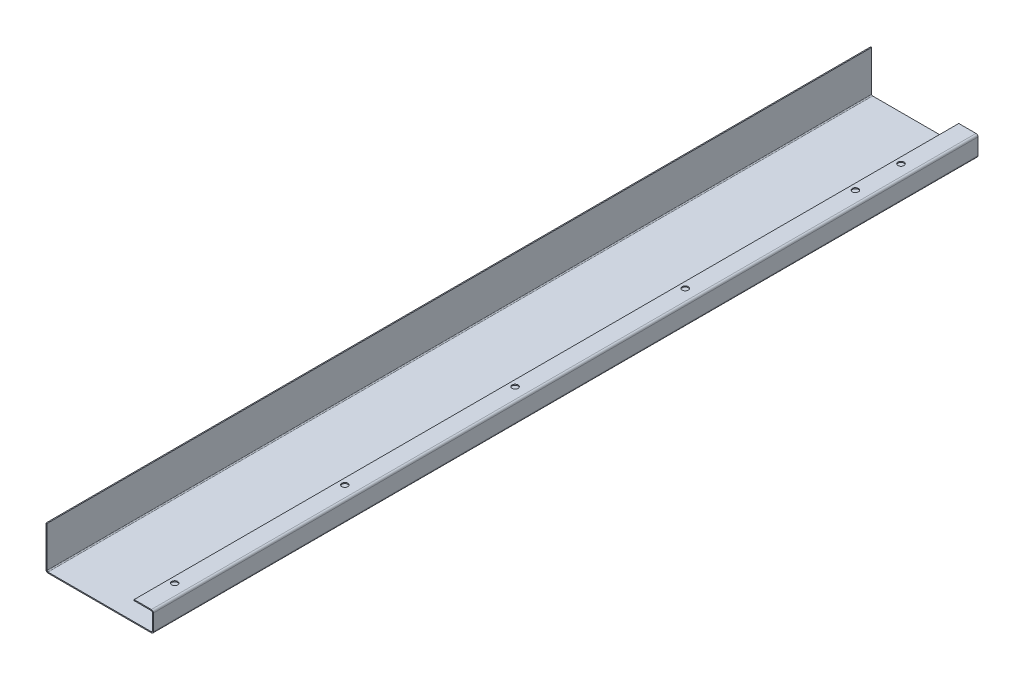
ISO-10303-21;
HEADER;
FILE_DESCRIPTION(('STEP AP214'),'2;1');
FILE_NAME('part.step','',(''),(''),'','','');
FILE_SCHEMA(('AUTOMOTIVE_DESIGN { 1 0 10303 214 1 1 1 1 }'));
ENDSEC;
DATA;
#1=APPLICATION_CONTEXT('core data for automotive mechanical design processes');
#2=APPLICATION_PROTOCOL_DEFINITION('international standard','automotive_design',2000,#1);
#3=PRODUCT_CONTEXT('',#1,'mechanical');
#4=PRODUCT('Part','Part','',(#3));
#5=PRODUCT_RELATED_PRODUCT_CATEGORY('part','',(#4));
#6=PRODUCT_DEFINITION_FORMATION('','',#4);
#7=PRODUCT_DEFINITION_CONTEXT('part definition',#1,'design');
#8=PRODUCT_DEFINITION('design','',#6,#7);
#9=PRODUCT_DEFINITION_SHAPE('','',#8);
#10=(LENGTH_UNIT() NAMED_UNIT(*) SI_UNIT(.MILLI.,.METRE.));
#11=(NAMED_UNIT(*) PLANE_ANGLE_UNIT() SI_UNIT($,.RADIAN.));
#12=(NAMED_UNIT(*) SI_UNIT($,.STERADIAN.) SOLID_ANGLE_UNIT());
#13=UNCERTAINTY_MEASURE_WITH_UNIT(LENGTH_MEASURE(1.E-05),#10,'distance_accuracy_value','');
#14=(GEOMETRIC_REPRESENTATION_CONTEXT(3) GLOBAL_UNCERTAINTY_ASSIGNED_CONTEXT((#13)) GLOBAL_UNIT_ASSIGNED_CONTEXT((#10,
#11,#12)) REPRESENTATION_CONTEXT('',''));
#15=CARTESIAN_POINT('',(0.,0.,0.));
#16=DIRECTION('',(0.,0.,1.));
#17=DIRECTION('',(1.,0.,0.));
#18=AXIS2_PLACEMENT_3D('',#15,#16,#17);
#19=CARTESIAN_POINT('',(0.,-1.,0.));
#20=DIRECTION('',(0.,-1.,0.));
#21=DIRECTION('',(0.,0.,-1.));
#22=AXIS2_PLACEMENT_3D('',#19,#20,#21);
#23=PLANE('',#22);
#24=DIRECTION('',(1.,0.,0.));
#25=VECTOR('',#24,1.);
#26=CARTESIAN_POINT('',(0.,-1.,0.));
#27=LINE('',#26,#25);
#28=CARTESIAN_POINT('',(2.00000000000007,-1.0000000000001,0.));
#29=VERTEX_POINT('',#28);
#30=CARTESIAN_POINT('',(104.,-1.,0.));
#31=VERTEX_POINT('',#30);
#32=EDGE_CURVE('E112',#29,#31,#27,.T.);
#33=ORIENTED_EDGE('',*,*,#32,.F.);
#34=DIRECTION('',(0.,0.,1.));
#35=VECTOR('',#34,1.);
#36=CARTESIAN_POINT('',(2.00000000000007,-1.0000000000001,0.));
#37=LINE('',#36,#35);
#38=CARTESIAN_POINT('',(2.,-1.,-814.));
#39=VERTEX_POINT('',#38);
#40=EDGE_CURVE('E273',#29,#39,#37,.F.);
#41=ORIENTED_EDGE('',*,*,#40,.T.);
#42=DIRECTION('',(-1.,0.,0.));
#43=VECTOR('',#42,1.);
#44=CARTESIAN_POINT('',(-1.38777878078145E-13,-1.,-814.));
#45=LINE('',#44,#43);
#46=CARTESIAN_POINT('',(104.,-1.0000000000001,-814.));
#47=VERTEX_POINT('',#46);
#48=EDGE_CURVE('E13',#47,#39,#45,.T.);
#49=ORIENTED_EDGE('',*,*,#48,.F.);
#50=DIRECTION('',(0.,0.,-1.));
#51=VECTOR('',#50,1.);
#52=CARTESIAN_POINT('',(104.,-1.0000000000001,-814.));
#53=LINE('',#52,#51);
#54=EDGE_CURVE('E402',#47,#31,#53,.F.);
#55=ORIENTED_EDGE('',*,*,#54,.T.);
#56=EDGE_LOOP('',(#33,#41,#49,#55));
#57=FACE_BOUND('',#56,.T.);
#58=ADVANCED_FACE('F102',(#57),#23,.T.);
#59=CARTESIAN_POINT('',(0.,0.,0.));
#60=DIRECTION('',(0.,-1.,0.));
#61=DIRECTION('',(0.,0.,-1.));
#62=AXIS2_PLACEMENT_3D('',#59,#60,#61);
#63=PLANE('',#62);
#64=DIRECTION('',(0.,0.,1.));
#65=VECTOR('',#64,1.);
#66=CARTESIAN_POINT('',(2.,0.,0.));
#67=LINE('',#66,#65);
#68=CARTESIAN_POINT('',(2.,0.,0.));
#69=VERTEX_POINT('',#68);
#70=CARTESIAN_POINT('',(2.,0.,-814.));
#71=VERTEX_POINT('',#70);
#72=EDGE_CURVE('E290',#69,#71,#67,.F.);
#73=ORIENTED_EDGE('',*,*,#72,.F.);
#74=DIRECTION('',(1.,0.,0.));
#75=VECTOR('',#74,1.);
#76=CARTESIAN_POINT('',(0.,0.,0.));
#77=LINE('',#76,#75);
#78=CARTESIAN_POINT('',(104.,-1.00397121172158E-13,0.));
#79=VERTEX_POINT('',#78);
#80=EDGE_CURVE('E430',#69,#79,#77,.T.);
#81=ORIENTED_EDGE('',*,*,#80,.T.);
#82=DIRECTION('',(0.,0.,-1.));
#83=VECTOR('',#82,1.);
#84=CARTESIAN_POINT('',(104.,-1.00397121172158E-13,-814.));
#85=LINE('',#84,#83);
#86=CARTESIAN_POINT('',(104.,-1.00397121172158E-13,-814.));
#87=VERTEX_POINT('',#86);
#88=EDGE_CURVE('E419',#87,#79,#85,.F.);
#89=ORIENTED_EDGE('',*,*,#88,.F.);
#90=DIRECTION('',(-1.,0.,0.));
#91=VECTOR('',#90,1.);
#92=CARTESIAN_POINT('',(-1.38777878078145E-13,0.,-814.));
#93=LINE('',#92,#91);
#94=EDGE_CURVE('E435',#87,#71,#93,.T.);
#95=ORIENTED_EDGE('',*,*,#94,.T.);
#96=EDGE_LOOP('',(#73,#81,#89,#95));
#97=FACE_BOUND('',#96,.T.);
#98=ADVANCED_FACE('F525',(#97),#63,.F.);
#99=CARTESIAN_POINT('',(0.,-1.,0.));
#100=DIRECTION('',(0.,0.,1.));
#101=DIRECTION('',(1.,0.,0.));
#102=AXIS2_PLACEMENT_3D('',#99,#100,#101);
#103=PLANE('',#102);
#104=ORIENTED_EDGE('',*,*,#80,.F.);
#105=DIRECTION('',(0.,-1.,0.));
#106=VECTOR('',#105,1.);
#107=CARTESIAN_POINT('',(2.,0.,0.));
#108=LINE('',#107,#106);
#109=EDGE_CURVE('E282',#69,#29,#108,.T.);
#110=ORIENTED_EDGE('',*,*,#109,.T.);
#111=ORIENTED_EDGE('',*,*,#32,.T.);
#112=DIRECTION('',(0.,-1.,0.));
#113=VECTOR('',#112,1.);
#114=CARTESIAN_POINT('',(104.,-1.00397121172158E-13,0.));
#115=LINE('',#114,#113);
#116=EDGE_CURVE('E426',#79,#31,#115,.T.);
#117=ORIENTED_EDGE('',*,*,#116,.F.);
#118=EDGE_LOOP('',(#104,#110,#111,#117));
#119=FACE_BOUND('',#118,.T.);
#120=ADVANCED_FACE('F104',(#119),#103,.T.);
#121=CARTESIAN_POINT('',(106.,0.,0.));
#122=DIRECTION('',(0.,0.,-1.));
#123=DIRECTION('',(0.,1.,0.));
#124=AXIS2_PLACEMENT_3D('',#121,#122,#123);
#125=PLANE('',#124);
#126=DIRECTION('',(1.,0.,0.));
#127=VECTOR('',#126,1.);
#128=CARTESIAN_POINT('',(105.000000000003,17.,0.));
#129=LINE('',#128,#127);
#130=CARTESIAN_POINT('',(105.000000000003,17.,0.));
#131=VERTEX_POINT('',#130);
#132=CARTESIAN_POINT('',(106.,17.,0.));
#133=VERTEX_POINT('',#132);
#134=EDGE_CURVE('E367',#131,#133,#129,.T.);
#135=ORIENTED_EDGE('',*,*,#134,.F.);
#136=DIRECTION('',(0.,1.,0.));
#137=VECTOR('',#136,1.);
#138=CARTESIAN_POINT('',(105.,0.,0.));
#139=LINE('',#138,#137);
#140=CARTESIAN_POINT('',(105.,0.99999999999998,0.));
#141=VERTEX_POINT('',#140);
#142=EDGE_CURVE('E385',#131,#141,#139,.F.);
#143=ORIENTED_EDGE('',*,*,#142,.T.);
#144=DIRECTION('',(-1.,0.,0.));
#145=VECTOR('',#144,1.);
#146=CARTESIAN_POINT('',(106.,0.999999999999997,0.));
#147=LINE('',#146,#145);
#148=CARTESIAN_POINT('',(106.,0.999999999999976,0.));
#149=VERTEX_POINT('',#148);
#150=EDGE_CURVE('E371',#141,#149,#147,.F.);
#151=ORIENTED_EDGE('',*,*,#150,.T.);
#152=DIRECTION('',(0.,-1.,0.));
#153=VECTOR('',#152,1.);
#154=CARTESIAN_POINT('',(106.,-3.90608720188404E-13,0.));
#155=LINE('',#154,#153);
#156=EDGE_CURVE('E379',#133,#149,#155,.T.);
#157=ORIENTED_EDGE('',*,*,#156,.F.);
#158=EDGE_LOOP('',(#135,#143,#151,#157));
#159=FACE_BOUND('',#158,.T.);
#160=ADVANCED_FACE('F574',(#159),#125,.F.);
#161=CARTESIAN_POINT('',(106.,19.,-814.));
#162=DIRECTION('',(0.,0.,1.));
#163=DIRECTION('',(1.,0.,0.));
#164=AXIS2_PLACEMENT_3D('',#161,#162,#163);
#165=PLANE('',#164);
#166=DIRECTION('',(1.,0.,0.));
#167=VECTOR('',#166,1.);
#168=CARTESIAN_POINT('',(104.999999999997,17.,-814.));
#169=LINE('',#168,#167);
#170=CARTESIAN_POINT('',(105.,17.,-814.));
#171=VERTEX_POINT('',#170);
#172=CARTESIAN_POINT('',(105.999999999997,17.,-814.));
#173=VERTEX_POINT('',#172);
#174=EDGE_CURVE('E354',#171,#173,#169,.T.);
#175=ORIENTED_EDGE('',*,*,#174,.T.);
#176=DIRECTION('',(0.,1.,0.));
#177=VECTOR('',#176,1.);
#178=CARTESIAN_POINT('',(106.,-3.90608720188404E-13,-814.));
#179=LINE('',#178,#177);
#180=CARTESIAN_POINT('',(106.,0.999999999999956,-814.));
#181=VERTEX_POINT('',#180);
#182=EDGE_CURVE('E375',#181,#173,#179,.T.);
#183=ORIENTED_EDGE('',*,*,#182,.F.);
#184=DIRECTION('',(-1.,0.,0.));
#185=VECTOR('',#184,1.);
#186=CARTESIAN_POINT('',(105.,0.999999999999959,-814.));
#187=LINE('',#186,#185);
#188=CARTESIAN_POINT('',(105.,0.99999999999998,-814.));
#189=VERTEX_POINT('',#188);
#190=EDGE_CURVE('E392',#189,#181,#187,.F.);
#191=ORIENTED_EDGE('',*,*,#190,.F.);
#192=DIRECTION('',(0.,-1.,0.));
#193=VECTOR('',#192,1.);
#194=CARTESIAN_POINT('',(105.,19.,-814.));
#195=LINE('',#194,#193);
#196=EDGE_CURVE('E382',#189,#171,#195,.F.);
#197=ORIENTED_EDGE('',*,*,#196,.T.);
#198=EDGE_LOOP('',(#175,#183,#191,#197));
#199=FACE_BOUND('',#198,.T.);
#200=ADVANCED_FACE('F572',(#199),#165,.F.);
#201=CARTESIAN_POINT('',(106.,-3.90608720188404E-13,0.));
#202=DIRECTION('',(-1.,0.,0.));
#203=DIRECTION('',(0.,-1.,0.));
#204=AXIS2_PLACEMENT_3D('',#201,#202,#203);
#205=PLANE('',#204);
#206=DIRECTION('',(0.,0.,-1.));
#207=VECTOR('',#206,1.);
#208=CARTESIAN_POINT('',(105.999999999997,17.,-814.));
#209=LINE('',#208,#207);
#210=EDGE_CURVE('E346',#173,#133,#209,.F.);
#211=ORIENTED_EDGE('',*,*,#210,.T.);
#212=ORIENTED_EDGE('',*,*,#156,.T.);
#213=DIRECTION('',(0.,0.,-1.));
#214=VECTOR('',#213,1.);
#215=CARTESIAN_POINT('',(106.,0.999999999999997,0.));
#216=LINE('',#215,#214);
#217=EDGE_CURVE('E388',#181,#149,#216,.F.);
#218=ORIENTED_EDGE('',*,*,#217,.F.);
#219=ORIENTED_EDGE('',*,*,#182,.T.);
#220=EDGE_LOOP('',(#211,#212,#218,#219));
#221=FACE_BOUND('',#220,.T.);
#222=ADVANCED_FACE('F546',(#221),#205,.F.);
#223=CARTESIAN_POINT('',(105.,-3.87117238849561E-13,0.));
#224=DIRECTION('',(-1.,0.,0.));
#225=DIRECTION('',(0.,-1.,0.));
#226=AXIS2_PLACEMENT_3D('',#223,#224,#225);
#227=PLANE('',#226);
#228=ORIENTED_EDGE('',*,*,#142,.F.);
#229=DIRECTION('',(0.,0.,-1.));
#230=VECTOR('',#229,1.);
#231=CARTESIAN_POINT('',(104.999999999997,17.,-814.));
#232=LINE('',#231,#230);
#233=EDGE_CURVE('E120',#171,#131,#232,.F.);
#234=ORIENTED_EDGE('',*,*,#233,.F.);
#235=ORIENTED_EDGE('',*,*,#196,.F.);
#236=DIRECTION('',(0.,0.,-1.));
#237=VECTOR('',#236,1.);
#238=CARTESIAN_POINT('',(105.,1.,0.));
#239=LINE('',#238,#237);
#240=EDGE_CURVE('E396',#141,#189,#239,.T.);
#241=ORIENTED_EDGE('',*,*,#240,.F.);
#242=EDGE_LOOP('',(#228,#234,#235,#241));
#243=FACE_BOUND('',#242,.T.);
#244=ADVANCED_FACE('F539',(#243),#227,.T.);
#245=CARTESIAN_POINT('',(-1.38777878078145E-13,-1.,-814.));
#246=DIRECTION('',(0.,0.,-1.));
#247=DIRECTION('',(-1.,0.,0.));
#248=AXIS2_PLACEMENT_3D('',#245,#246,#247);
#249=PLANE('',#248);
#250=DIRECTION('',(0.,-1.,0.));
#251=VECTOR('',#250,1.);
#252=CARTESIAN_POINT('',(2.,0.,-814.));
#253=LINE('',#252,#251);
#254=EDGE_CURVE('E297',#71,#39,#253,.T.);
#255=ORIENTED_EDGE('',*,*,#254,.F.);
#256=ORIENTED_EDGE('',*,*,#94,.F.);
#257=DIRECTION('',(0.,-1.,0.));
#258=VECTOR('',#257,1.);
#259=CARTESIAN_POINT('',(104.,-1.00397121172158E-13,-814.));
#260=LINE('',#259,#258);
#261=EDGE_CURVE('E411',#87,#47,#260,.T.);
#262=ORIENTED_EDGE('',*,*,#261,.T.);
#263=ORIENTED_EDGE('',*,*,#48,.T.);
#264=EDGE_LOOP('',(#255,#256,#262,#263));
#265=FACE_BOUND('',#264,.T.);
#266=ADVANCED_FACE('F536',(#265),#249,.T.);
#267=CARTESIAN_POINT('',(104.,0.999999999999984,0.));
#268=DIRECTION('',(0.,0.,1.));
#269=DIRECTION('',(1.,0.,0.));
#270=AXIS2_PLACEMENT_3D('',#267,#268,#269);
#271=PLANE('',#270);
#272=ORIENTED_EDGE('',*,*,#150,.F.);
#273=CARTESIAN_POINT('',(104.,0.999999999999984,0.));
#274=DIRECTION('',(0.,0.,-1.));
#275=DIRECTION('',(-1.,0.,0.));
#276=AXIS2_PLACEMENT_3D('',#273,#274,#275);
#277=CIRCLE('',#276,1.00000000000008);
#278=EDGE_CURVE('E415',#79,#141,#277,.F.);
#279=ORIENTED_EDGE('',*,*,#278,.F.);
#280=ORIENTED_EDGE('',*,*,#116,.T.);
#281=CARTESIAN_POINT('',(104.,0.999999999999984,0.));
#282=DIRECTION('',(0.,0.,-1.));
#283=DIRECTION('',(-1.,0.,0.));
#284=AXIS2_PLACEMENT_3D('',#281,#282,#283);
#285=CIRCLE('',#284,2.00000000000008);
#286=EDGE_CURVE('E406',#31,#149,#285,.F.);
#287=ORIENTED_EDGE('',*,*,#286,.T.);
#288=EDGE_LOOP('',(#272,#279,#280,#287));
#289=FACE_BOUND('',#288,.T.);
#290=ADVANCED_FACE('F538',(#289),#271,.T.);
#291=CARTESIAN_POINT('',(104.,0.999999999999984,-814.));
#292=DIRECTION('',(0.,0.,1.));
#293=DIRECTION('',(1.,0.,0.));
#294=AXIS2_PLACEMENT_3D('',#291,#292,#293);
#295=PLANE('',#294);
#296=CARTESIAN_POINT('',(104.,0.999999999999984,-814.));
#297=DIRECTION('',(0.,0.,-1.));
#298=DIRECTION('',(-1.,0.,0.));
#299=AXIS2_PLACEMENT_3D('',#296,#297,#298);
#300=CIRCLE('',#299,1.00000000000008);
#301=EDGE_CURVE('E378',#189,#87,#300,.T.);
#302=ORIENTED_EDGE('',*,*,#301,.F.);
#303=ORIENTED_EDGE('',*,*,#190,.T.);
#304=CARTESIAN_POINT('',(104.,0.999999999999984,-814.));
#305=DIRECTION('',(0.,0.,-1.));
#306=DIRECTION('',(-1.,0.,0.));
#307=AXIS2_PLACEMENT_3D('',#304,#305,#306);
#308=CIRCLE('',#307,2.00000000000008);
#309=EDGE_CURVE('E407',#181,#47,#308,.T.);
#310=ORIENTED_EDGE('',*,*,#309,.T.);
#311=ORIENTED_EDGE('',*,*,#261,.F.);
#312=EDGE_LOOP('',(#302,#303,#310,#311));
#313=FACE_BOUND('',#312,.T.);
#314=ADVANCED_FACE('F534',(#313),#295,.F.);
#315=CARTESIAN_POINT('',(104.,0.999999999999984,-814.));
#316=DIRECTION('',(0.,0.,-1.));
#317=DIRECTION('',(1.,0.,0.));
#318=AXIS2_PLACEMENT_3D('',#315,#316,#317);
#319=CYLINDRICAL_SURFACE('',#318,2.00000000000008);
#320=ORIENTED_EDGE('',*,*,#54,.F.);
#321=ORIENTED_EDGE('',*,*,#309,.F.);
#322=ORIENTED_EDGE('',*,*,#217,.T.);
#323=ORIENTED_EDGE('',*,*,#286,.F.);
#324=EDGE_LOOP('',(#320,#321,#322,#323));
#325=FACE_BOUND('',#324,.T.);
#326=ADVANCED_FACE('F564',(#325),#319,.T.);
#327=CARTESIAN_POINT('',(104.,0.999999999999984,-814.));
#328=DIRECTION('',(0.,0.,-1.));
#329=DIRECTION('',(1.,0.,0.));
#330=AXIS2_PLACEMENT_3D('',#327,#328,#329);
#331=CYLINDRICAL_SURFACE('',#330,1.00000000000008);
#332=ORIENTED_EDGE('',*,*,#88,.T.);
#333=ORIENTED_EDGE('',*,*,#278,.T.);
#334=ORIENTED_EDGE('',*,*,#240,.T.);
#335=ORIENTED_EDGE('',*,*,#301,.T.);
#336=EDGE_LOOP('',(#332,#333,#334,#335));
#337=FACE_BOUND('',#336,.T.);
#338=ADVANCED_FACE('F557',(#337),#331,.F.);
#339=CARTESIAN_POINT('',(104.000000000003,17.,0.));
#340=DIRECTION('',(0.,0.,1.));
#341=DIRECTION('',(1.,0.,0.));
#342=AXIS2_PLACEMENT_3D('',#339,#340,#341);
#343=PLANE('',#342);
#344=DIRECTION('',(0.,-1.,0.));
#345=VECTOR('',#344,1.);
#346=CARTESIAN_POINT('',(104.,19.,0.));
#347=LINE('',#346,#345);
#348=CARTESIAN_POINT('',(104.000000000003,18.,0.));
#349=VERTEX_POINT('',#348);
#350=CARTESIAN_POINT('',(104.000000000003,19.,0.));
#351=VERTEX_POINT('',#350);
#352=EDGE_CURVE('E301',#349,#351,#347,.F.);
#353=ORIENTED_EDGE('',*,*,#352,.F.);
#354=CARTESIAN_POINT('',(104.000000000003,17.,0.));
#355=DIRECTION('',(0.,0.,-1.));
#356=DIRECTION('',(-1.,0.,0.));
#357=AXIS2_PLACEMENT_3D('',#354,#355,#356);
#358=CIRCLE('',#357,1.);
#359=EDGE_CURVE('E358',#131,#349,#358,.F.);
#360=ORIENTED_EDGE('',*,*,#359,.F.);
#361=ORIENTED_EDGE('',*,*,#134,.T.);
#362=CARTESIAN_POINT('',(104.000000000003,17.,0.));
#363=DIRECTION('',(0.,0.,-1.));
#364=DIRECTION('',(-1.,0.,0.));
#365=AXIS2_PLACEMENT_3D('',#362,#363,#364);
#366=CIRCLE('',#365,2.);
#367=EDGE_CURVE('E349',#133,#351,#366,.F.);
#368=ORIENTED_EDGE('',*,*,#367,.T.);
#369=EDGE_LOOP('',(#353,#360,#361,#368));
#370=FACE_BOUND('',#369,.T.);
#371=ADVANCED_FACE('F507',(#370),#343,.T.);
#372=CARTESIAN_POINT('',(103.999999999997,17.,-814.));
#373=DIRECTION('',(0.,0.,1.));
#374=DIRECTION('',(1.,0.,0.));
#375=AXIS2_PLACEMENT_3D('',#372,#373,#374);
#376=PLANE('',#375);
#377=CARTESIAN_POINT('',(103.999999999997,17.,-814.));
#378=DIRECTION('',(0.,0.,-1.));
#379=DIRECTION('',(-1.,0.,0.));
#380=AXIS2_PLACEMENT_3D('',#377,#378,#379);
#381=CIRCLE('',#380,1.);
#382=CARTESIAN_POINT('',(103.999999999997,18.,-814.));
#383=VERTEX_POINT('',#382);
#384=EDGE_CURVE('E308',#383,#171,#381,.T.);
#385=ORIENTED_EDGE('',*,*,#384,.F.);
#386=DIRECTION('',(0.,-1.,0.));
#387=VECTOR('',#386,1.);
#388=CARTESIAN_POINT('',(104.,18.,-814.));
#389=LINE('',#388,#387);
#390=CARTESIAN_POINT('',(104.,19.,-814.));
#391=VERTEX_POINT('',#390);
#392=EDGE_CURVE('E336',#383,#391,#389,.F.);
#393=ORIENTED_EDGE('',*,*,#392,.T.);
#394=CARTESIAN_POINT('',(103.999999999997,17.,-814.));
#395=DIRECTION('',(0.,0.,-1.));
#396=DIRECTION('',(-1.,0.,0.));
#397=AXIS2_PLACEMENT_3D('',#394,#395,#396);
#398=CIRCLE('',#397,2.);
#399=EDGE_CURVE('E350',#391,#173,#398,.T.);
#400=ORIENTED_EDGE('',*,*,#399,.T.);
#401=ORIENTED_EDGE('',*,*,#174,.F.);
#402=EDGE_LOOP('',(#385,#393,#400,#401));
#403=FACE_BOUND('',#402,.T.);
#404=ADVANCED_FACE('F497',(#403),#376,.F.);
#405=CARTESIAN_POINT('',(103.999999999997,17.,-814.));
#406=DIRECTION('',(0.,0.,-1.));
#407=DIRECTION('',(0.,1.,0.));
#408=AXIS2_PLACEMENT_3D('',#405,#406,#407);
#409=CYLINDRICAL_SURFACE('',#408,2.);
#410=ORIENTED_EDGE('',*,*,#210,.F.);
#411=ORIENTED_EDGE('',*,*,#399,.F.);
#412=DIRECTION('',(0.,0.,-1.));
#413=VECTOR('',#412,1.);
#414=CARTESIAN_POINT('',(104.,19.,0.));
#415=LINE('',#414,#413);
#416=EDGE_CURVE('E333',#391,#351,#415,.F.);
#417=ORIENTED_EDGE('',*,*,#416,.T.);
#418=ORIENTED_EDGE('',*,*,#367,.F.);
#419=EDGE_LOOP('',(#410,#411,#417,#418));
#420=FACE_BOUND('',#419,.T.);
#421=ADVANCED_FACE('F505',(#420),#409,.T.);
#422=CARTESIAN_POINT('',(103.999999999997,17.,-814.));
#423=DIRECTION('',(0.,0.,-1.));
#424=DIRECTION('',(0.,1.,0.));
#425=AXIS2_PLACEMENT_3D('',#422,#423,#424);
#426=CYLINDRICAL_SURFACE('',#425,1.);
#427=ORIENTED_EDGE('',*,*,#233,.T.);
#428=ORIENTED_EDGE('',*,*,#359,.T.);
#429=DIRECTION('',(0.,0.,-1.));
#430=VECTOR('',#429,1.);
#431=CARTESIAN_POINT('',(104.,18.,0.));
#432=LINE('',#431,#430);
#433=EDGE_CURVE('E340',#349,#383,#432,.T.);
#434=ORIENTED_EDGE('',*,*,#433,.T.);
#435=ORIENTED_EDGE('',*,*,#384,.T.);
#436=EDGE_LOOP('',(#427,#428,#434,#435));
#437=FACE_BOUND('',#436,.T.);
#438=ADVANCED_FACE('F576',(#437),#426,.F.);
#439=CARTESIAN_POINT('',(86.9999999999999,19.0000000000001,-814.));
#440=DIRECTION('',(0.,0.,1.));
#441=DIRECTION('',(0.,-1.,0.));
#442=AXIS2_PLACEMENT_3D('',#439,#440,#441);
#443=PLANE('',#442);
#444=ORIENTED_EDGE('',*,*,#392,.F.);
#445=DIRECTION('',(1.,0.,0.));
#446=VECTOR('',#445,1.);
#447=CARTESIAN_POINT('',(86.9999999999999,18.0000000000001,-814.));
#448=LINE('',#447,#446);
#449=CARTESIAN_POINT('',(86.9999999999999,18.0000000000001,-814.));
#450=VERTEX_POINT('',#449);
#451=EDGE_CURVE('E330',#383,#450,#448,.F.);
#452=ORIENTED_EDGE('',*,*,#451,.T.);
#453=DIRECTION('',(0.,-1.,0.));
#454=VECTOR('',#453,1.);
#455=CARTESIAN_POINT('',(86.9999999999999,19.0000000000001,-814.));
#456=LINE('',#455,#454);
#457=CARTESIAN_POINT('',(86.9999999999999,19.0000000000001,-814.));
#458=VERTEX_POINT('',#457);
#459=EDGE_CURVE('E304',#458,#450,#456,.T.);
#460=ORIENTED_EDGE('',*,*,#459,.F.);
#461=DIRECTION('',(-1.,0.,0.));
#462=VECTOR('',#461,1.);
#463=CARTESIAN_POINT('',(1.38992659517926E-13,19.0000000000007,-814.));
#464=LINE('',#463,#462);
#465=EDGE_CURVE('E320',#391,#458,#464,.T.);
#466=ORIENTED_EDGE('',*,*,#465,.F.);
#467=EDGE_LOOP('',(#444,#452,#460,#466));
#468=FACE_BOUND('',#467,.T.);
#469=ADVANCED_FACE('F492',(#468),#443,.F.);
#470=CARTESIAN_POINT('',(105.,19.,0.));
#471=DIRECTION('',(0.,0.,-1.));
#472=DIRECTION('',(-1.,0.,0.));
#473=AXIS2_PLACEMENT_3D('',#470,#471,#472);
#474=PLANE('',#473);
#475=ORIENTED_EDGE('',*,*,#352,.T.);
#476=DIRECTION('',(1.,0.,0.));
#477=VECTOR('',#476,1.);
#478=CARTESIAN_POINT('',(1.38992659517926E-13,19.0000000000007,0.));
#479=LINE('',#478,#477);
#480=CARTESIAN_POINT('',(87.0000000000001,19.0000000000001,0.));
#481=VERTEX_POINT('',#480);
#482=EDGE_CURVE('E313',#481,#351,#479,.T.);
#483=ORIENTED_EDGE('',*,*,#482,.F.);
#484=DIRECTION('',(0.,-1.,0.));
#485=VECTOR('',#484,1.);
#486=CARTESIAN_POINT('',(87.0000000000001,19.0000000000001,0.));
#487=LINE('',#486,#485);
#488=CARTESIAN_POINT('',(87.0000000000001,18.0000000000001,0.));
#489=VERTEX_POINT('',#488);
#490=EDGE_CURVE('E309',#481,#489,#487,.T.);
#491=ORIENTED_EDGE('',*,*,#490,.T.);
#492=DIRECTION('',(-1.,0.,0.));
#493=VECTOR('',#492,1.);
#494=CARTESIAN_POINT('',(105.,18.,0.));
#495=LINE('',#494,#493);
#496=EDGE_CURVE('E323',#489,#349,#495,.F.);
#497=ORIENTED_EDGE('',*,*,#496,.T.);
#498=EDGE_LOOP('',(#475,#483,#491,#497));
#499=FACE_BOUND('',#498,.T.);
#500=ADVANCED_FACE('F510',(#499),#474,.F.);
#501=CARTESIAN_POINT('',(1.38992659517926E-13,19.0000000000007,0.));
#502=DIRECTION('',(0.,-1.,0.));
#503=DIRECTION('',(1.,0.,0.));
#504=AXIS2_PLACEMENT_3D('',#501,#502,#503);
#505=PLANE('',#504);
#506=CARTESIAN_POINT('',(92.9999999999999,19.0000000000001,-751.));
#507=DIRECTION('',(0.,1.,0.));
#508=DIRECTION('',(-1.,0.,0.));
#509=AXIS2_PLACEMENT_3D('',#506,#507,#508);
#510=CIRCLE('',#509,3.00000000000001);
#511=CARTESIAN_POINT('',(89.9999999999999,19.0000000000001,-751.));
#512=VERTEX_POINT('',#511);
#513=EDGE_CURVE('E447',#512,#512,#510,.T.);
#514=ORIENTED_EDGE('',*,*,#513,.F.);
#515=EDGE_LOOP('',(#514));
#516=FACE_BOUND('',#515,.T.);
#517=CARTESIAN_POINT('',(92.9999999999999,19.0000000000001,-706.));
#518=DIRECTION('',(0.,1.,0.));
#519=DIRECTION('',(-1.,0.,0.));
#520=AXIS2_PLACEMENT_3D('',#517,#518,#519);
#521=CIRCLE('',#520,3.00000000000001);
#522=CARTESIAN_POINT('',(89.9999999999999,19.0000000000001,-706.));
#523=VERTEX_POINT('',#522);
#524=EDGE_CURVE('E858',#523,#523,#521,.T.);
#525=ORIENTED_EDGE('',*,*,#524,.F.);
#526=EDGE_LOOP('',(#525));
#527=FACE_BOUND('',#526,.T.);
#528=CARTESIAN_POINT('',(93.0000000000041,19.0000000000001,-538.));
#529=DIRECTION('',(0.,1.,0.));
#530=DIRECTION('',(-1.,0.,0.));
#531=AXIS2_PLACEMENT_3D('',#528,#529,#530);
#532=CIRCLE('',#531,3.00000000000001);
#533=CARTESIAN_POINT('',(90.0000000000041,19.0000000000001,-538.));
#534=VERTEX_POINT('',#533);
#535=EDGE_CURVE('E861',#534,#534,#532,.T.);
#536=ORIENTED_EDGE('',*,*,#535,.F.);
#537=EDGE_LOOP('',(#536));
#538=FACE_BOUND('',#537,.T.);
#539=CARTESIAN_POINT('',(93.0000000000082,19.0000000000001,-370.));
#540=DIRECTION('',(0.,1.,0.));
#541=DIRECTION('',(-1.,0.,0.));
#542=AXIS2_PLACEMENT_3D('',#539,#540,#541);
#543=CIRCLE('',#542,3.00000000000001);
#544=CARTESIAN_POINT('',(90.0000000000082,19.0000000000001,-370.));
#545=VERTEX_POINT('',#544);
#546=EDGE_CURVE('E868',#545,#545,#543,.T.);
#547=ORIENTED_EDGE('',*,*,#546,.F.);
#548=EDGE_LOOP('',(#547));
#549=FACE_BOUND('',#548,.T.);
#550=CARTESIAN_POINT('',(93.0000000000124,19.0000000000001,-202.));
#551=DIRECTION('',(0.,1.,0.));
#552=DIRECTION('',(-1.,0.,0.));
#553=AXIS2_PLACEMENT_3D('',#550,#551,#552);
#554=CIRCLE('',#553,3.00000000000001);
#555=CARTESIAN_POINT('',(90.0000000000124,19.0000000000001,-202.));
#556=VERTEX_POINT('',#555);
#557=EDGE_CURVE('E874',#556,#556,#554,.T.);
#558=ORIENTED_EDGE('',*,*,#557,.F.);
#559=EDGE_LOOP('',(#558));
#560=FACE_BOUND('',#559,.T.);
#561=CARTESIAN_POINT('',(93.0000000000165,19.0000000000001,-33.9999999999998));
#562=DIRECTION('',(0.,1.,0.));
#563=DIRECTION('',(-1.,0.,0.));
#564=AXIS2_PLACEMENT_3D('',#561,#562,#563);
#565=CIRCLE('',#564,3.00000000000001);
#566=CARTESIAN_POINT('',(90.0000000000165,19.0000000000001,-33.9999999999998));
#567=VERTEX_POINT('',#566);
#568=EDGE_CURVE('E878',#567,#567,#565,.T.);
#569=ORIENTED_EDGE('',*,*,#568,.F.);
#570=EDGE_LOOP('',(#569));
#571=FACE_BOUND('',#570,.T.);
#572=ORIENTED_EDGE('',*,*,#416,.F.);
#573=ORIENTED_EDGE('',*,*,#465,.T.);
#574=DIRECTION('',(0.,0.,1.));
#575=VECTOR('',#574,1.);
#576=CARTESIAN_POINT('',(87.0000000000001,19.0000000000001,0.));
#577=LINE('',#576,#575);
#578=EDGE_CURVE('E317',#458,#481,#577,.T.);
#579=ORIENTED_EDGE('',*,*,#578,.T.);
#580=ORIENTED_EDGE('',*,*,#482,.T.);
#581=EDGE_LOOP('',(#572,#573,#579,#580));
#582=FACE_BOUND('',#581,.T.);
#583=ADVANCED_FACE('F474',(#516,#527,#538,#549,#560,#571,#582),#505,.F.);
#584=CARTESIAN_POINT('',(1.31849128755974E-13,18.0000000000007,0.));
#585=DIRECTION('',(0.,-1.,0.));
#586=DIRECTION('',(1.,0.,0.));
#587=AXIS2_PLACEMENT_3D('',#584,#585,#586);
#588=PLANE('',#587);
#589=CARTESIAN_POINT('',(92.9999999999999,18.0000000000001,-751.));
#590=DIRECTION('',(0.,-1.,0.));
#591=DIRECTION('',(1.,0.,0.));
#592=AXIS2_PLACEMENT_3D('',#589,#590,#591);
#593=CIRCLE('',#592,3.00000000000001);
#594=CARTESIAN_POINT('',(95.9999999999999,18.0000000000001,-751.));
#595=VERTEX_POINT('',#594);
#596=EDGE_CURVE('E106',#595,#595,#593,.T.);
#597=ORIENTED_EDGE('',*,*,#596,.F.);
#598=EDGE_LOOP('',(#597));
#599=FACE_BOUND('',#598,.T.);
#600=CARTESIAN_POINT('',(92.9999999999999,18.0000000000001,-706.));
#601=DIRECTION('',(0.,-1.,0.));
#602=DIRECTION('',(1.,0.,0.));
#603=AXIS2_PLACEMENT_3D('',#600,#601,#602);
#604=CIRCLE('',#603,3.00000000000001);
#605=CARTESIAN_POINT('',(95.9999999999999,18.0000000000001,-706.));
#606=VERTEX_POINT('',#605);
#607=EDGE_CURVE('E458',#606,#606,#604,.T.);
#608=ORIENTED_EDGE('',*,*,#607,.F.);
#609=EDGE_LOOP('',(#608));
#610=FACE_BOUND('',#609,.T.);
#611=CARTESIAN_POINT('',(93.0000000000041,18.0000000000001,-538.));
#612=DIRECTION('',(0.,-1.,0.));
#613=DIRECTION('',(1.,0.,0.));
#614=AXIS2_PLACEMENT_3D('',#611,#612,#613);
#615=CIRCLE('',#614,3.00000000000001);
#616=CARTESIAN_POINT('',(96.0000000000041,18.0000000000001,-538.));
#617=VERTEX_POINT('',#616);
#618=EDGE_CURVE('E455',#617,#617,#615,.T.);
#619=ORIENTED_EDGE('',*,*,#618,.F.);
#620=EDGE_LOOP('',(#619));
#621=FACE_BOUND('',#620,.T.);
#622=CARTESIAN_POINT('',(93.0000000000082,18.0000000000001,-370.));
#623=DIRECTION('',(0.,-1.,0.));
#624=DIRECTION('',(1.,0.,0.));
#625=AXIS2_PLACEMENT_3D('',#622,#623,#624);
#626=CIRCLE('',#625,3.00000000000001);
#627=CARTESIAN_POINT('',(96.0000000000082,18.0000000000001,-370.));
#628=VERTEX_POINT('',#627);
#629=EDGE_CURVE('E451',#628,#628,#626,.T.);
#630=ORIENTED_EDGE('',*,*,#629,.F.);
#631=EDGE_LOOP('',(#630));
#632=FACE_BOUND('',#631,.T.);
#633=CARTESIAN_POINT('',(93.0000000000124,18.0000000000001,-202.));
#634=DIRECTION('',(0.,-1.,0.));
#635=DIRECTION('',(1.,0.,0.));
#636=AXIS2_PLACEMENT_3D('',#633,#634,#635);
#637=CIRCLE('',#636,3.00000000000001);
#638=CARTESIAN_POINT('',(96.0000000000124,18.0000000000001,-202.));
#639=VERTEX_POINT('',#638);
#640=EDGE_CURVE('E446',#639,#639,#637,.T.);
#641=ORIENTED_EDGE('',*,*,#640,.F.);
#642=EDGE_LOOP('',(#641));
#643=FACE_BOUND('',#642,.T.);
#644=CARTESIAN_POINT('',(93.0000000000165,18.0000000000001,-33.9999999999998));
#645=DIRECTION('',(0.,-1.,0.));
#646=DIRECTION('',(1.,0.,0.));
#647=AXIS2_PLACEMENT_3D('',#644,#645,#646);
#648=CIRCLE('',#647,3.00000000000001);
#649=CARTESIAN_POINT('',(96.0000000000165,18.0000000000001,-33.9999999999998));
#650=VERTEX_POINT('',#649);
#651=EDGE_CURVE('E442',#650,#650,#648,.T.);
#652=ORIENTED_EDGE('',*,*,#651,.F.);
#653=EDGE_LOOP('',(#652));
#654=FACE_BOUND('',#653,.T.);
#655=ORIENTED_EDGE('',*,*,#451,.F.);
#656=ORIENTED_EDGE('',*,*,#433,.F.);
#657=ORIENTED_EDGE('',*,*,#496,.F.);
#658=DIRECTION('',(0.,0.,-1.));
#659=VECTOR('',#658,1.);
#660=CARTESIAN_POINT('',(87.0000000000001,18.0000000000001,0.));
#661=LINE('',#660,#659);
#662=EDGE_CURVE('E327',#450,#489,#661,.F.);
#663=ORIENTED_EDGE('',*,*,#662,.F.);
#664=EDGE_LOOP('',(#655,#656,#657,#663));
#665=FACE_BOUND('',#664,.T.);
#666=ADVANCED_FACE('F470',(#599,#610,#621,#632,#643,#654,#665),#588,.T.);
#667=CARTESIAN_POINT('',(87.0000000000001,19.0000000000001,0.));
#668=DIRECTION('',(1.,0.,0.));
#669=DIRECTION('',(0.,1.,0.));
#670=AXIS2_PLACEMENT_3D('',#667,#668,#669);
#671=PLANE('',#670);
#672=ORIENTED_EDGE('',*,*,#662,.T.);
#673=ORIENTED_EDGE('',*,*,#490,.F.);
#674=ORIENTED_EDGE('',*,*,#578,.F.);
#675=ORIENTED_EDGE('',*,*,#459,.T.);
#676=EDGE_LOOP('',(#672,#673,#674,#675));
#677=FACE_BOUND('',#676,.T.);
#678=ADVANCED_FACE('F473',(#677),#671,.F.);
#679=CARTESIAN_POINT('',(1.99999999999993,0.999999999999971,-814.));
#680=DIRECTION('',(0.,0.,-1.));
#681=DIRECTION('',(-1.,0.,0.));
#682=AXIS2_PLACEMENT_3D('',#679,#680,#681);
#683=PLANE('',#682);
#684=DIRECTION('',(1.,0.,0.));
#685=VECTOR('',#684,1.);
#686=CARTESIAN_POINT('',(-1.42269359416988E-13,0.999999999999993,-814.));
#687=LINE('',#686,#685);
#688=CARTESIAN_POINT('',(0.999999999999858,0.999999999999967,-814.));
#689=VERTEX_POINT('',#688);
#690=CARTESIAN_POINT('',(-1.42247325030098E-13,0.999999999999964,-814.));
#691=VERTEX_POINT('',#690);
#692=EDGE_CURVE('E247',#689,#691,#687,.F.);
#693=ORIENTED_EDGE('',*,*,#692,.F.);
#694=CARTESIAN_POINT('',(1.99999999999993,0.999999999999971,-814.));
#695=DIRECTION('',(0.,0.,1.));
#696=DIRECTION('',(1.,0.,0.));
#697=AXIS2_PLACEMENT_3D('',#694,#695,#696);
#698=CIRCLE('',#697,1.00000000000007);
#699=EDGE_CURVE('E286',#71,#689,#698,.F.);
#700=ORIENTED_EDGE('',*,*,#699,.F.);
#701=ORIENTED_EDGE('',*,*,#254,.T.);
#702=CARTESIAN_POINT('',(1.99999999999993,0.999999999999971,-814.));
#703=DIRECTION('',(0.,0.,1.));
#704=DIRECTION('',(1.,0.,0.));
#705=AXIS2_PLACEMENT_3D('',#702,#703,#704);
#706=CIRCLE('',#705,2.00000000000007);
#707=EDGE_CURVE('E277',#39,#691,#706,.F.);
#708=ORIENTED_EDGE('',*,*,#707,.T.);
#709=EDGE_LOOP('',(#693,#700,#701,#708));
#710=FACE_BOUND('',#709,.T.);
#711=ADVANCED_FACE('F514',(#710),#683,.T.);
#712=CARTESIAN_POINT('',(1.99999999999993,0.999999999999971,0.));
#713=DIRECTION('',(0.,0.,-1.));
#714=DIRECTION('',(-1.,0.,0.));
#715=AXIS2_PLACEMENT_3D('',#712,#713,#714);
#716=PLANE('',#715);
#717=CARTESIAN_POINT('',(1.99999999999993,0.999999999999971,0.));
#718=DIRECTION('',(0.,0.,1.));
#719=DIRECTION('',(1.,0.,0.));
#720=AXIS2_PLACEMENT_3D('',#717,#718,#719);
#721=CIRCLE('',#720,1.00000000000007);
#722=CARTESIAN_POINT('',(0.999999999999858,0.999999999999967,0.));
#723=VERTEX_POINT('',#722);
#724=EDGE_CURVE('E293',#723,#69,#721,.T.);
#725=ORIENTED_EDGE('',*,*,#724,.F.);
#726=DIRECTION('',(1.,0.,0.));
#727=VECTOR('',#726,1.);
#728=CARTESIAN_POINT('',(0.999999999999997,0.999999999999938,0.));
#729=LINE('',#728,#727);
#730=CARTESIAN_POINT('',(0.,0.999999999999934,0.));
#731=VERTEX_POINT('',#730);
#732=EDGE_CURVE('E264',#723,#731,#729,.F.);
#733=ORIENTED_EDGE('',*,*,#732,.T.);
#734=CARTESIAN_POINT('',(1.99999999999993,0.999999999999971,0.));
#735=DIRECTION('',(0.,0.,1.));
#736=DIRECTION('',(1.,0.,0.));
#737=AXIS2_PLACEMENT_3D('',#734,#735,#736);
#738=CIRCLE('',#737,2.00000000000007);
#739=EDGE_CURVE('E278',#731,#29,#738,.T.);
#740=ORIENTED_EDGE('',*,*,#739,.T.);
#741=ORIENTED_EDGE('',*,*,#109,.F.);
#742=EDGE_LOOP('',(#725,#733,#740,#741));
#743=FACE_BOUND('',#742,.T.);
#744=ADVANCED_FACE('F519',(#743),#716,.F.);
#745=CARTESIAN_POINT('',(1.99999999999993,0.999999999999971,0.));
#746=DIRECTION('',(0.,0.,1.));
#747=DIRECTION('',(-1.,0.,0.));
#748=AXIS2_PLACEMENT_3D('',#745,#746,#747);
#749=CYLINDRICAL_SURFACE('',#748,2.00000000000007);
#750=ORIENTED_EDGE('',*,*,#40,.F.);
#751=ORIENTED_EDGE('',*,*,#739,.F.);
#752=DIRECTION('',(0.,0.,1.));
#753=VECTOR('',#752,1.);
#754=CARTESIAN_POINT('',(-1.42247325030098E-13,0.999999999999993,-814.));
#755=LINE('',#754,#753);
#756=EDGE_CURVE('E261',#731,#691,#755,.F.);
#757=ORIENTED_EDGE('',*,*,#756,.T.);
#758=ORIENTED_EDGE('',*,*,#707,.F.);
#759=EDGE_LOOP('',(#750,#751,#757,#758));
#760=FACE_BOUND('',#759,.T.);
#761=ADVANCED_FACE('F686',(#760),#749,.T.);
#762=CARTESIAN_POINT('',(1.99999999999993,0.999999999999971,0.));
#763=DIRECTION('',(0.,0.,1.));
#764=DIRECTION('',(-1.,0.,0.));
#765=AXIS2_PLACEMENT_3D('',#762,#763,#764);
#766=CYLINDRICAL_SURFACE('',#765,1.00000000000007);
#767=ORIENTED_EDGE('',*,*,#72,.T.);
#768=ORIENTED_EDGE('',*,*,#699,.T.);
#769=DIRECTION('',(0.,0.,1.));
#770=VECTOR('',#769,1.);
#771=CARTESIAN_POINT('',(0.999999999999858,0.999999999999997,-814.));
#772=LINE('',#771,#770);
#773=EDGE_CURVE('E268',#689,#723,#772,.T.);
#774=ORIENTED_EDGE('',*,*,#773,.T.);
#775=ORIENTED_EDGE('',*,*,#724,.T.);
#776=EDGE_LOOP('',(#767,#768,#774,#775));
#777=FACE_BOUND('',#776,.T.);
#778=ADVANCED_FACE('F696',(#777),#766,.F.);
#779=CARTESIAN_POINT('',(-1.38777878078145E-13,0.,-814.));
#780=DIRECTION('',(0.,0.,1.));
#781=DIRECTION('',(1.,0.,0.));
#782=AXIS2_PLACEMENT_3D('',#779,#780,#781);
#783=PLANE('',#782);
#784=ORIENTED_EDGE('',*,*,#692,.T.);
#785=DIRECTION('',(0.,-1.,0.));
#786=VECTOR('',#785,1.);
#787=CARTESIAN_POINT('',(-1.38777878078145E-13,0.,-814.));
#788=LINE('',#787,#786);
#789=CARTESIAN_POINT('',(-2.81928612970713E-13,41.,-814.));
#790=VERTEX_POINT('',#789);
#791=EDGE_CURVE('E226',#790,#691,#788,.T.);
#792=ORIENTED_EDGE('',*,*,#791,.F.);
#793=DIRECTION('',(1.,0.,0.));
#794=VECTOR('',#793,1.);
#795=CARTESIAN_POINT('',(-2.81928612970713E-13,41.,-814.));
#796=LINE('',#795,#794);
#797=CARTESIAN_POINT('',(0.999999999999718,41.,-814.));
#798=VERTEX_POINT('',#797);
#799=EDGE_CURVE('E233',#790,#798,#796,.T.);
#800=ORIENTED_EDGE('',*,*,#799,.T.);
#801=DIRECTION('',(0.,1.,0.));
#802=VECTOR('',#801,1.);
#803=CARTESIAN_POINT('',(0.999999999999861,0.,-814.));
#804=LINE('',#803,#802);
#805=EDGE_CURVE('E258',#798,#689,#804,.F.);
#806=ORIENTED_EDGE('',*,*,#805,.T.);
#807=EDGE_LOOP('',(#784,#792,#800,#806));
#808=FACE_BOUND('',#807,.T.);
#809=ADVANCED_FACE('F246',(#808),#783,.F.);
#810=CARTESIAN_POINT('',(-1.43114686768087E-13,41.,0.));
#811=DIRECTION('',(0.,0.,-1.));
#812=DIRECTION('',(-1.,0.,0.));
#813=AXIS2_PLACEMENT_3D('',#810,#811,#812);
#814=PLANE('',#813);
#815=ORIENTED_EDGE('',*,*,#732,.F.);
#816=DIRECTION('',(0.,-1.,0.));
#817=VECTOR('',#816,1.);
#818=CARTESIAN_POINT('',(0.999999999999857,41.,0.));
#819=LINE('',#818,#817);
#820=CARTESIAN_POINT('',(0.999999999999857,41.,0.));
#821=VERTEX_POINT('',#820);
#822=EDGE_CURVE('E253',#723,#821,#819,.F.);
#823=ORIENTED_EDGE('',*,*,#822,.T.);
#824=DIRECTION('',(1.,0.,0.));
#825=VECTOR('',#824,1.);
#826=CARTESIAN_POINT('',(-1.43114686768087E-13,41.,0.));
#827=LINE('',#826,#825);
#828=CARTESIAN_POINT('',(-1.43150734892568E-13,41.,0.));
#829=VERTEX_POINT('',#828);
#830=EDGE_CURVE('E243',#829,#821,#827,.T.);
#831=ORIENTED_EDGE('',*,*,#830,.F.);
#832=DIRECTION('',(0.,1.,0.));
#833=VECTOR('',#832,1.);
#834=CARTESIAN_POINT('',(0.,0.,0.));
#835=LINE('',#834,#833);
#836=EDGE_CURVE('E228',#731,#829,#835,.T.);
#837=ORIENTED_EDGE('',*,*,#836,.F.);
#838=EDGE_LOOP('',(#815,#823,#831,#837));
#839=FACE_BOUND('',#838,.T.);
#840=ADVANCED_FACE('F717',(#839),#814,.F.);
#841=CARTESIAN_POINT('',(0.,0.,0.));
#842=DIRECTION('',(1.,0.,0.));
#843=DIRECTION('',(0.,1.,0.));
#844=AXIS2_PLACEMENT_3D('',#841,#842,#843);
#845=PLANE('',#844);
#846=ORIENTED_EDGE('',*,*,#756,.F.);
#847=ORIENTED_EDGE('',*,*,#836,.T.);
#848=DIRECTION('',(0.,0.,-1.));
#849=VECTOR('',#848,1.);
#850=CARTESIAN_POINT('',(-1.43150734892568E-13,41.,0.));
#851=LINE('',#850,#849);
#852=EDGE_CURVE('E221',#829,#790,#851,.T.);
#853=ORIENTED_EDGE('',*,*,#852,.T.);
#854=ORIENTED_EDGE('',*,*,#791,.T.);
#855=EDGE_LOOP('',(#846,#847,#853,#854));
#856=FACE_BOUND('',#855,.T.);
#857=ADVANCED_FACE('F224',(#856),#845,.F.);
#858=CARTESIAN_POINT('',(1.,0.,0.));
#859=DIRECTION('',(1.,0.,0.));
#860=DIRECTION('',(0.,1.,0.));
#861=AXIS2_PLACEMENT_3D('',#858,#859,#860);
#862=PLANE('',#861);
#863=ORIENTED_EDGE('',*,*,#822,.F.);
#864=ORIENTED_EDGE('',*,*,#773,.F.);
#865=ORIENTED_EDGE('',*,*,#805,.F.);
#866=DIRECTION('',(0.,0.,1.));
#867=VECTOR('',#866,1.);
#868=CARTESIAN_POINT('',(0.999999999999718,41.,-814.));
#869=LINE('',#868,#867);
#870=EDGE_CURVE('E238',#821,#798,#869,.F.);
#871=ORIENTED_EDGE('',*,*,#870,.F.);
#872=EDGE_LOOP('',(#863,#864,#865,#871));
#873=FACE_BOUND('',#872,.T.);
#874=ADVANCED_FACE('F737',(#873),#862,.T.);
#875=CARTESIAN_POINT('',(-2.81892564846231E-13,41.,-814.));
#876=DIRECTION('',(0.,-1.,0.));
#877=DIRECTION('',(1.,0.,0.));
#878=AXIS2_PLACEMENT_3D('',#875,#876,#877);
#879=PLANE('',#878);
#880=ORIENTED_EDGE('',*,*,#870,.T.);
#881=ORIENTED_EDGE('',*,*,#799,.F.);
#882=ORIENTED_EDGE('',*,*,#852,.F.);
#883=ORIENTED_EDGE('',*,*,#830,.T.);
#884=EDGE_LOOP('',(#880,#881,#882,#883));
#885=FACE_BOUND('',#884,.T.);
#886=ADVANCED_FACE('F236',(#885),#879,.F.);
#887=CARTESIAN_POINT('',(93.0000000000165,9.00000000000008,-33.9999999999998));
#888=DIRECTION('',(0.,1.,0.));
#889=DIRECTION('',(-1.,0.,0.));
#890=AXIS2_PLACEMENT_3D('',#887,#888,#889);
#891=CYLINDRICAL_SURFACE('',#890,3.00000000000001);
#892=ORIENTED_EDGE('',*,*,#651,.T.);
#893=EDGE_LOOP('',(#892));
#894=FACE_BOUND('',#893,.T.);
#895=ORIENTED_EDGE('',*,*,#568,.T.);
#896=EDGE_LOOP('',(#895));
#897=FACE_BOUND('',#896,.T.);
#898=ADVANCED_FACE('F757',(#894,#897),#891,.F.);
#899=CARTESIAN_POINT('',(93.0000000000123,9.00000000000008,-202.));
#900=DIRECTION('',(0.,1.,0.));
#901=DIRECTION('',(-1.,0.,0.));
#902=AXIS2_PLACEMENT_3D('',#899,#900,#901);
#903=CYLINDRICAL_SURFACE('',#902,3.00000000000001);
#904=ORIENTED_EDGE('',*,*,#640,.T.);
#905=EDGE_LOOP('',(#904));
#906=FACE_BOUND('',#905,.T.);
#907=ORIENTED_EDGE('',*,*,#557,.T.);
#908=EDGE_LOOP('',(#907));
#909=FACE_BOUND('',#908,.T.);
#910=ADVANCED_FACE('F781',(#906,#909),#903,.F.);
#911=CARTESIAN_POINT('',(93.0000000000082,9.00000000000008,-370.));
#912=DIRECTION('',(0.,1.,0.));
#913=DIRECTION('',(-1.,0.,0.));
#914=AXIS2_PLACEMENT_3D('',#911,#912,#913);
#915=CYLINDRICAL_SURFACE('',#914,3.00000000000001);
#916=ORIENTED_EDGE('',*,*,#629,.T.);
#917=EDGE_LOOP('',(#916));
#918=FACE_BOUND('',#917,.T.);
#919=ORIENTED_EDGE('',*,*,#546,.T.);
#920=EDGE_LOOP('',(#919));
#921=FACE_BOUND('',#920,.T.);
#922=ADVANCED_FACE('F792',(#918,#921),#915,.F.);
#923=CARTESIAN_POINT('',(93.000000000004,9.00000000000008,-538.));
#924=DIRECTION('',(0.,1.,0.));
#925=DIRECTION('',(-1.,0.,0.));
#926=AXIS2_PLACEMENT_3D('',#923,#924,#925);
#927=CYLINDRICAL_SURFACE('',#926,3.00000000000001);
#928=ORIENTED_EDGE('',*,*,#618,.T.);
#929=EDGE_LOOP('',(#928));
#930=FACE_BOUND('',#929,.T.);
#931=ORIENTED_EDGE('',*,*,#535,.T.);
#932=EDGE_LOOP('',(#931));
#933=FACE_BOUND('',#932,.T.);
#934=ADVANCED_FACE('F803',(#930,#933),#927,.F.);
#935=CARTESIAN_POINT('',(92.9999999999999,9.00000000000008,-706.));
#936=DIRECTION('',(0.,1.,0.));
#937=DIRECTION('',(-1.,0.,0.));
#938=AXIS2_PLACEMENT_3D('',#935,#936,#937);
#939=CYLINDRICAL_SURFACE('',#938,3.00000000000001);
#940=ORIENTED_EDGE('',*,*,#607,.T.);
#941=EDGE_LOOP('',(#940));
#942=FACE_BOUND('',#941,.T.);
#943=ORIENTED_EDGE('',*,*,#524,.T.);
#944=EDGE_LOOP('',(#943));
#945=FACE_BOUND('',#944,.T.);
#946=ADVANCED_FACE('F814',(#942,#945),#939,.F.);
#947=CARTESIAN_POINT('',(92.9999999999999,9.00000000000008,-751.));
#948=DIRECTION('',(0.,1.,0.));
#949=DIRECTION('',(-1.,0.,0.));
#950=AXIS2_PLACEMENT_3D('',#947,#948,#949);
#951=CYLINDRICAL_SURFACE('',#950,3.00000000000001);
#952=ORIENTED_EDGE('',*,*,#596,.T.);
#953=EDGE_LOOP('',(#952));
#954=FACE_BOUND('',#953,.T.);
#955=ORIENTED_EDGE('',*,*,#513,.T.);
#956=EDGE_LOOP('',(#955));
#957=FACE_BOUND('',#956,.T.);
#958=ADVANCED_FACE('F467',(#954,#957),#951,.F.);
#959=CLOSED_SHELL('',(#58,#98,#120,#160,#200,#222,#244,#266,#290,#314,#326,#338,#371,#404,#421,
#438,#469,#500,#583,#666,#678,#711,#744,#761,#778,#809,#840,#857,#874,#886,#898,#910,#922,#934,
#946,#958));
#960=MANIFOLD_SOLID_BREP('B2',#959);
#961=ADVANCED_BREP_SHAPE_REPRESENTATION('',(#18,#960),#14);
#962=SHAPE_DEFINITION_REPRESENTATION(#9,#961);
ENDSEC;
END-ISO-10303-21;
